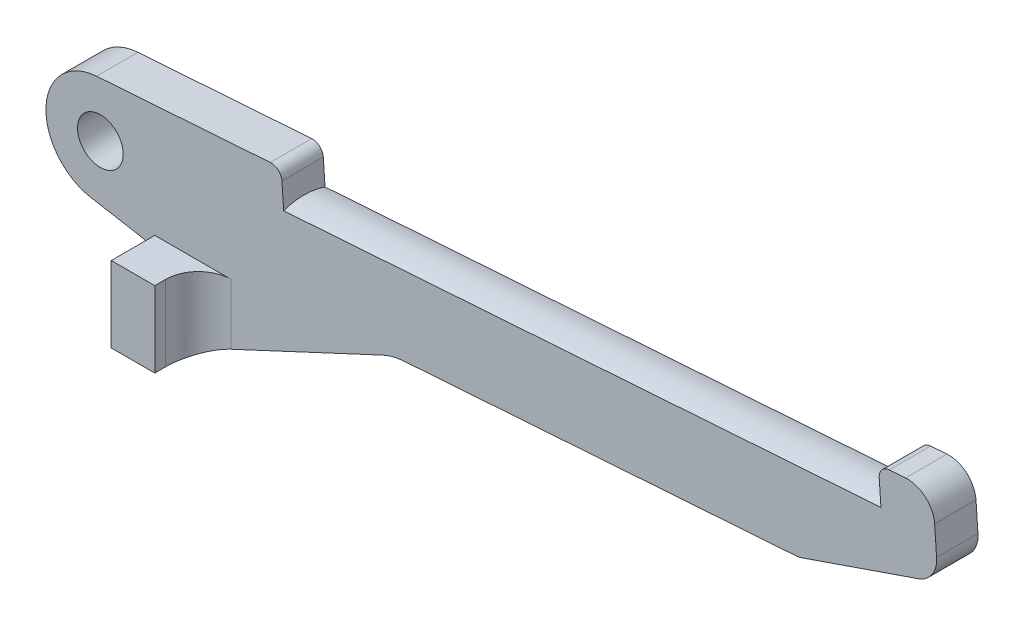
ISO-10303-21;
HEADER;
FILE_DESCRIPTION(('STEP AP214'),'2;1');
FILE_NAME('part.step','',(''),(''),'','','');
FILE_SCHEMA(('AUTOMOTIVE_DESIGN { 1 0 10303 214 1 1 1 1 }'));
ENDSEC;
DATA;
#1=APPLICATION_CONTEXT('core data for automotive mechanical design processes');
#2=APPLICATION_PROTOCOL_DEFINITION('international standard','automotive_design',2000,#1);
#3=PRODUCT_CONTEXT('',#1,'mechanical');
#4=PRODUCT('Part','Part','',(#3));
#5=PRODUCT_RELATED_PRODUCT_CATEGORY('part','',(#4));
#6=PRODUCT_DEFINITION_FORMATION('','',#4);
#7=PRODUCT_DEFINITION_CONTEXT('part definition',#1,'design');
#8=PRODUCT_DEFINITION('design','',#6,#7);
#9=PRODUCT_DEFINITION_SHAPE('','',#8);
#10=(LENGTH_UNIT() NAMED_UNIT(*) SI_UNIT(.MILLI.,.METRE.));
#11=(NAMED_UNIT(*) PLANE_ANGLE_UNIT() SI_UNIT($,.RADIAN.));
#12=(NAMED_UNIT(*) SI_UNIT($,.STERADIAN.) SOLID_ANGLE_UNIT());
#13=UNCERTAINTY_MEASURE_WITH_UNIT(LENGTH_MEASURE(1.E-05),#10,'distance_accuracy_value','');
#14=(GEOMETRIC_REPRESENTATION_CONTEXT(3) GLOBAL_UNCERTAINTY_ASSIGNED_CONTEXT((#13)) GLOBAL_UNIT_ASSIGNED_CONTEXT((#10,
#11,#12)) REPRESENTATION_CONTEXT('',''));
#15=CARTESIAN_POINT('',(0.,0.,0.));
#16=DIRECTION('',(0.,0.,1.));
#17=DIRECTION('',(1.,0.,0.));
#18=AXIS2_PLACEMENT_3D('',#15,#16,#17);
#19=CARTESIAN_POINT('',(0.,0.,7.6));
#20=DIRECTION('',(0.,0.,1.));
#21=DIRECTION('',(1.,0.,0.));
#22=AXIS2_PLACEMENT_3D('',#19,#20,#21);
#23=PLANE('',#22);
#24=DIRECTION('',(-0.997564050259824,-0.06975647374413,0.));
#25=VECTOR('',#24,1.);
#26=CARTESIAN_POINT('',(142.951658499973,20.0205727217529,7.6));
#27=LINE('',#26,#25);
#28=CARTESIAN_POINT('',(147.939478751272,20.3693550904736,7.6));
#29=VERTEX_POINT('',#28);
#30=CARTESIAN_POINT('',(144.946786600493,20.1600856692411,7.6));
#31=VERTEX_POINT('',#30);
#32=EDGE_CURVE('E389',#29,#31,#27,.T.);
#33=ORIENTED_EDGE('',*,*,#32,.T.);
#34=CARTESIAN_POINT('',(145.086299547981,18.1649575687215,7.6));
#35=DIRECTION('',(0.,0.,1.));
#36=DIRECTION('',(1.,0.,0.));
#37=AXIS2_PLACEMENT_3D('',#34,#35,#36);
#38=CIRCLE('',#37,2.);
#39=CARTESIAN_POINT('',(143.091171447462,18.0254446212332,7.6));
#40=VERTEX_POINT('',#39);
#41=EDGE_CURVE('E284',#31,#40,#38,.T.);
#42=ORIENTED_EDGE('',*,*,#41,.T.);
#43=DIRECTION('',(0.0697564737441314,-0.997564050259824,0.));
#44=VECTOR('',#43,1.);
#45=CARTESIAN_POINT('',(143.370197342438,14.0351884201939,7.6));
#46=LINE('',#45,#44);
#47=CARTESIAN_POINT('',(143.413275967594,13.4191353790388,7.6));
#48=VERTEX_POINT('',#47);
#49=EDGE_CURVE('E388',#40,#48,#46,.T.);
#50=ORIENTED_EDGE('',*,*,#49,.T.);
#51=DIRECTION('',(-0.997564050259824,-0.0697564737441294,0.));
#52=VECTOR('',#51,1.);
#53=CARTESIAN_POINT('',(153.466032644996,14.1220926047334,7.6));
#54=LINE('',#53,#52);
#55=CARTESIAN_POINT('',(33.6812304390136,5.74592326718459,7.6));
#56=VERTEX_POINT('',#55);
#57=EDGE_CURVE('E209',#48,#56,#54,.T.);
#58=ORIENTED_EDGE('',*,*,#57,.T.);
#59=DIRECTION('',(-0.0697564737441282,0.997564050259824,0.));
#60=VECTOR('',#59,1.);
#61=CARTESIAN_POINT('',(33.2196129713927,12.3473606098986,7.6));
#62=LINE('',#61,#60);
#63=CARTESIAN_POINT('',(33.359125918881,10.352232509379,7.6));
#64=VERTEX_POINT('',#63);
#65=EDGE_CURVE('E390',#56,#64,#62,.T.);
#66=ORIENTED_EDGE('',*,*,#65,.T.);
#67=CARTESIAN_POINT('',(31.3639978183613,10.2127195618907,7.6));
#68=DIRECTION('',(0.,0.,1.));
#69=DIRECTION('',(1.,0.,0.));
#70=AXIS2_PLACEMENT_3D('',#67,#68,#69);
#71=CIRCLE('',#70,2.);
#72=CARTESIAN_POINT('',(31.2244848708731,12.2078476624104,7.6));
#73=VERTEX_POINT('',#72);
#74=EDGE_CURVE('E47',#64,#73,#71,.T.);
#75=ORIENTED_EDGE('',*,*,#74,.T.);
#76=DIRECTION('',(-0.997564050259824,-0.0697564737441296,0.));
#77=VECTOR('',#76,1.);
#78=CARTESIAN_POINT('',(-0.697564737441295,9.97564050259824,7.6));
#79=LINE('',#78,#77);
#80=CARTESIAN_POINT('',(-0.697564737441295,9.97564050259824,7.6));
#81=VERTEX_POINT('',#80);
#82=EDGE_CURVE('E293',#73,#81,#79,.T.);
#83=ORIENTED_EDGE('',*,*,#82,.T.);
#84=CARTESIAN_POINT('',(0.,0.,7.6));
#85=DIRECTION('',(0.,0.,1.));
#86=DIRECTION('',(1.,0.,0.));
#87=AXIS2_PLACEMENT_3D('',#84,#85,#86);
#88=CIRCLE('',#87,10.);
#89=CARTESIAN_POINT('',(-1.73648177666923,-9.8480775301221,7.6));
#90=VERTEX_POINT('',#89);
#91=EDGE_CURVE('E298',#81,#90,#88,.T.);
#92=ORIENTED_EDGE('',*,*,#91,.T.);
#93=DIRECTION('',(0.984807753012209,-0.173648177666923,0.));
#94=VECTOR('',#93,1.);
#95=CARTESIAN_POINT('',(-1.73648177666923,-9.8480775301221,7.6));
#96=LINE('',#95,#94);
#97=CARTESIAN_POINT('',(7.52094453300077,-11.4804115604372,7.6));
#98=VERTEX_POINT('',#97);
#99=EDGE_CURVE('E255',#90,#98,#96,.T.);
#100=ORIENTED_EDGE('',*,*,#99,.T.);
#101=CARTESIAN_POINT('',(7.,-14.4348348194739,7.6));
#102=DIRECTION('',(0.,0.,-1.));
#103=DIRECTION('',(-1.,0.,0.));
#104=AXIS2_PLACEMENT_3D('',#101,#102,#103);
#105=CIRCLE('',#104,3.);
#106=CARTESIAN_POINT('',(10.,-14.4348348194739,7.6));
#107=VERTEX_POINT('',#106);
#108=EDGE_CURVE('E252',#98,#107,#105,.T.);
#109=ORIENTED_EDGE('',*,*,#108,.T.);
#110=DIRECTION('',(0.,-1.,0.));
#111=VECTOR('',#110,1.);
#112=CARTESIAN_POINT('',(10.,-23.917535925942,7.6));
#113=LINE('',#112,#111);
#114=CARTESIAN_POINT('',(10.,-10.,7.6));
#115=VERTEX_POINT('',#114);
#116=EDGE_CURVE('E232',#115,#107,#113,.T.);
#117=ORIENTED_EDGE('',*,*,#116,.F.);
#118=DIRECTION('',(-1.,0.,0.));
#119=VECTOR('',#118,1.);
#120=CARTESIAN_POINT('',(10.,-10.,7.6));
#121=LINE('',#120,#119);
#122=CARTESIAN_POINT('',(24.,-10.,7.6));
#123=VERTEX_POINT('',#122);
#124=EDGE_CURVE('E223',#123,#115,#121,.T.);
#125=ORIENTED_EDGE('',*,*,#124,.F.);
#126=DIRECTION('',(0.,1.,0.));
#127=VECTOR('',#126,1.);
#128=CARTESIAN_POINT('',(24.,0.,7.6));
#129=LINE('',#128,#127);
#130=CARTESIAN_POINT('',(24.,-21.119689977012,7.6));
#131=VERTEX_POINT('',#130);
#132=EDGE_CURVE('E268',#123,#131,#129,.F.);
#133=ORIENTED_EDGE('',*,*,#132,.T.);
#134=DIRECTION('',(0.906307787036649,0.422618261740701,0.));
#135=VECTOR('',#134,1.);
#136=CARTESIAN_POINT('',(18.,-23.917535925942,7.6));
#137=LINE('',#136,#135);
#138=CARTESIAN_POINT('',(52.0166285974361,-8.05532150634318,7.6));
#139=VERTEX_POINT('',#138);
#140=EDGE_CURVE('E254',#131,#139,#137,.T.);
#141=ORIENTED_EDGE('',*,*,#140,.T.);
#142=CARTESIAN_POINT('',(56.2428112148431,-17.1183993767097,7.6));
#143=DIRECTION('',(0.,0.,-1.));
#144=DIRECTION('',(-1.,0.,0.));
#145=AXIS2_PLACEMENT_3D('',#142,#143,#144);
#146=CIRCLE('',#145,10.);
#147=CARTESIAN_POINT('',(55.5452464774018,-7.14275887411143,7.6));
#148=VERTEX_POINT('',#147);
#149=EDGE_CURVE('E406',#139,#148,#146,.T.);
#150=ORIENTED_EDGE('',*,*,#149,.T.);
#151=DIRECTION('',(0.997564050259824,0.0697564737441292,0.));
#152=VECTOR('',#151,1.);
#153=CARTESIAN_POINT('',(55.5452464774018,-7.14275887411143,7.6));
#154=LINE('',#153,#152);
#155=CARTESIAN_POINT('',(127.67480792198,-2.09896859540824,7.6));
#156=VERTEX_POINT('',#155);
#157=EDGE_CURVE('E404',#148,#156,#154,.T.);
#158=ORIENTED_EDGE('',*,*,#157,.T.);
#159=CARTESIAN_POINT('',(127.326025553259,2.88885165589089,7.6));
#160=DIRECTION('',(0.,0.,1.));
#161=DIRECTION('',(1.,0.,0.));
#162=AXIS2_PLACEMENT_3D('',#159,#160,#161);
#163=CIRCLE('',#162,5.);
#164=CARTESIAN_POINT('',(128.953866325545,-1.8387412221057,7.6));
#165=VERTEX_POINT('',#164);
#166=EDGE_CURVE('E402',#156,#165,#163,.T.);
#167=ORIENTED_EDGE('',*,*,#166,.T.);
#168=DIRECTION('',(0.945518575599318,0.325568154457154,0.));
#169=VECTOR('',#168,1.);
#170=CARTESIAN_POINT('',(150.276280031525,5.50315459884924,7.6));
#171=LINE('',#170,#169);
#172=CARTESIAN_POINT('',(150.276280031525,5.50315459884924,7.6));
#173=VERTEX_POINT('',#172);
#174=EDGE_CURVE('E400',#165,#173,#171,.T.);
#175=ORIENTED_EDGE('',*,*,#174,.T.);
#176=CARTESIAN_POINT('',(148.64843925924,10.2307474768458,7.6));
#177=DIRECTION('',(0.,0.,1.));
#178=DIRECTION('',(-1.,0.,0.));
#179=AXIS2_PLACEMENT_3D('',#176,#177,#178);
#180=CIRCLE('',#179,5.);
#181=CARTESIAN_POINT('',(153.636259510539,10.5795298455665,7.6));
#182=VERTEX_POINT('',#181);
#183=EDGE_CURVE('E398',#173,#182,#180,.T.);
#184=ORIENTED_EDGE('',*,*,#183,.T.);
#185=DIRECTION('',(-0.0697564737441285,0.997564050259824,0.));
#186=VECTOR('',#185,1.);
#187=CARTESIAN_POINT('',(153.636259510539,10.5795298455665,7.6));
#188=LINE('',#187,#186);
#189=CARTESIAN_POINT('',(153.276081371292,15.7303172078951,7.6));
#190=VERTEX_POINT('',#189);
#191=EDGE_CURVE('E396',#182,#190,#188,.T.);
#192=ORIENTED_EDGE('',*,*,#191,.T.);
#193=CARTESIAN_POINT('',(148.288261119993,15.3815348391744,7.6));
#194=DIRECTION('',(0.,0.,1.));
#195=DIRECTION('',(-1.,0.,0.));
#196=AXIS2_PLACEMENT_3D('',#193,#194,#195);
#197=CIRCLE('',#196,5.00000000000002);
#198=EDGE_CURVE('E392',#190,#29,#197,.T.);
#199=ORIENTED_EDGE('',*,*,#198,.T.);
#200=EDGE_LOOP('',(#33,#42,#50,#58,#66,#75,#83,#92,#100,#109,#117,#125,#133,#141,#150,#158,#167,
#175,#184,#192,#199));
#201=FACE_BOUND('',#200,.T.);
#202=CARTESIAN_POINT('',(0.,0.,7.6));
#203=DIRECTION('',(0.,0.,1.));
#204=DIRECTION('',(1.,0.,0.));
#205=AXIS2_PLACEMENT_3D('',#202,#203,#204);
#206=CIRCLE('',#205,4.2);
#207=CARTESIAN_POINT('',(4.2,0.,7.6));
#208=VERTEX_POINT('',#207);
#209=EDGE_CURVE('E245',#208,#208,#206,.T.);
#210=ORIENTED_EDGE('',*,*,#209,.F.);
#211=EDGE_LOOP('',(#210));
#212=FACE_BOUND('',#211,.T.);
#213=ADVANCED_FACE('F32',(#201,#212),#23,.T.);
#214=CARTESIAN_POINT('',(0.,0.,0.));
#215=DIRECTION('',(0.,0.,1.));
#216=DIRECTION('',(1.,0.,0.));
#217=AXIS2_PLACEMENT_3D('',#214,#215,#216);
#218=PLANE('',#217);
#219=DIRECTION('',(0.0697564737441314,-0.997564050259824,0.));
#220=VECTOR('',#219,1.);
#221=CARTESIAN_POINT('',(143.370197342438,14.0351884201939,0.));
#222=LINE('',#221,#220);
#223=CARTESIAN_POINT('',(143.091171447462,18.0254446212332,0.));
#224=VERTEX_POINT('',#223);
#225=CARTESIAN_POINT('',(143.413275967594,13.4191353790388,0.));
#226=VERTEX_POINT('',#225);
#227=EDGE_CURVE('E190',#224,#226,#222,.T.);
#228=ORIENTED_EDGE('',*,*,#227,.F.);
#229=CARTESIAN_POINT('',(145.086299547981,18.1649575687215,0.));
#230=DIRECTION('',(0.,0.,1.));
#231=DIRECTION('',(1.,0.,0.));
#232=AXIS2_PLACEMENT_3D('',#229,#230,#231);
#233=CIRCLE('',#232,2.);
#234=CARTESIAN_POINT('',(144.946786600493,20.1600856692411,0.));
#235=VERTEX_POINT('',#234);
#236=EDGE_CURVE('E279',#224,#235,#233,.F.);
#237=ORIENTED_EDGE('',*,*,#236,.T.);
#238=DIRECTION('',(-0.997564050259824,-0.06975647374413,0.));
#239=VECTOR('',#238,1.);
#240=CARTESIAN_POINT('',(142.951658499973,20.0205727217529,0.));
#241=LINE('',#240,#239);
#242=CARTESIAN_POINT('',(147.939478751272,20.3693550904736,0.));
#243=VERTEX_POINT('',#242);
#244=EDGE_CURVE('E201',#243,#235,#241,.T.);
#245=ORIENTED_EDGE('',*,*,#244,.F.);
#246=CARTESIAN_POINT('',(148.288261119993,15.3815348391744,0.));
#247=DIRECTION('',(0.,0.,1.));
#248=DIRECTION('',(-1.,0.,0.));
#249=AXIS2_PLACEMENT_3D('',#246,#247,#248);
#250=CIRCLE('',#249,5.00000000000002);
#251=CARTESIAN_POINT('',(153.276081371292,15.7303172078951,0.));
#252=VERTEX_POINT('',#251);
#253=EDGE_CURVE('E373',#252,#243,#250,.T.);
#254=ORIENTED_EDGE('',*,*,#253,.F.);
#255=DIRECTION('',(-0.0697564737441285,0.997564050259824,0.));
#256=VECTOR('',#255,1.);
#257=CARTESIAN_POINT('',(153.636259510539,10.5795298455665,0.));
#258=LINE('',#257,#256);
#259=CARTESIAN_POINT('',(153.636259510539,10.5795298455665,0.));
#260=VERTEX_POINT('',#259);
#261=EDGE_CURVE('E371',#260,#252,#258,.T.);
#262=ORIENTED_EDGE('',*,*,#261,.F.);
#263=CARTESIAN_POINT('',(148.64843925924,10.2307474768458,0.));
#264=DIRECTION('',(0.,0.,1.));
#265=DIRECTION('',(-1.,0.,0.));
#266=AXIS2_PLACEMENT_3D('',#263,#264,#265);
#267=CIRCLE('',#266,5.);
#268=CARTESIAN_POINT('',(150.276280031525,5.50315459884924,0.));
#269=VERTEX_POINT('',#268);
#270=EDGE_CURVE('E369',#269,#260,#267,.T.);
#271=ORIENTED_EDGE('',*,*,#270,.F.);
#272=DIRECTION('',(0.945518575599318,0.325568154457154,0.));
#273=VECTOR('',#272,1.);
#274=CARTESIAN_POINT('',(150.276280031525,5.50315459884924,0.));
#275=LINE('',#274,#273);
#276=CARTESIAN_POINT('',(128.953866325545,-1.8387412221057,0.));
#277=VERTEX_POINT('',#276);
#278=EDGE_CURVE('E367',#277,#269,#275,.T.);
#279=ORIENTED_EDGE('',*,*,#278,.F.);
#280=CARTESIAN_POINT('',(127.326025553259,2.88885165589089,0.));
#281=DIRECTION('',(0.,0.,1.));
#282=DIRECTION('',(1.,0.,0.));
#283=AXIS2_PLACEMENT_3D('',#280,#281,#282);
#284=CIRCLE('',#283,5.);
#285=CARTESIAN_POINT('',(127.67480792198,-2.09896859540824,0.));
#286=VERTEX_POINT('',#285);
#287=EDGE_CURVE('E365',#286,#277,#284,.T.);
#288=ORIENTED_EDGE('',*,*,#287,.F.);
#289=DIRECTION('',(0.997564050259824,0.0697564737441292,0.));
#290=VECTOR('',#289,1.);
#291=CARTESIAN_POINT('',(55.5452464774018,-7.14275887411143,0.));
#292=LINE('',#291,#290);
#293=CARTESIAN_POINT('',(55.5452464774018,-7.14275887411143,0.));
#294=VERTEX_POINT('',#293);
#295=EDGE_CURVE('E363',#294,#286,#292,.T.);
#296=ORIENTED_EDGE('',*,*,#295,.F.);
#297=CARTESIAN_POINT('',(56.2428112148431,-17.1183993767097,0.));
#298=DIRECTION('',(0.,0.,-1.));
#299=DIRECTION('',(-1.,0.,0.));
#300=AXIS2_PLACEMENT_3D('',#297,#298,#299);
#301=CIRCLE('',#300,10.);
#302=CARTESIAN_POINT('',(52.0166285974361,-8.05532150634318,0.));
#303=VERTEX_POINT('',#302);
#304=EDGE_CURVE('E361',#303,#294,#301,.T.);
#305=ORIENTED_EDGE('',*,*,#304,.F.);
#306=DIRECTION('',(0.906307787036649,0.422618261740701,0.));
#307=VECTOR('',#306,1.);
#308=CARTESIAN_POINT('',(18.,-23.917535925942,0.));
#309=LINE('',#308,#307);
#310=CARTESIAN_POINT('',(18.,-23.917535925942,0.));
#311=VERTEX_POINT('',#310);
#312=EDGE_CURVE('E359',#311,#303,#309,.T.);
#313=ORIENTED_EDGE('',*,*,#312,.F.);
#314=DIRECTION('',(1.,0.,0.));
#315=VECTOR('',#314,1.);
#316=CARTESIAN_POINT('',(10.,-23.917535925942,0.));
#317=LINE('',#316,#315);
#318=CARTESIAN_POINT('',(10.,-23.917535925942,0.));
#319=VERTEX_POINT('',#318);
#320=EDGE_CURVE('E357',#319,#311,#317,.T.);
#321=ORIENTED_EDGE('',*,*,#320,.F.);
#322=DIRECTION('',(0.,-1.,0.));
#323=VECTOR('',#322,1.);
#324=CARTESIAN_POINT('',(10.,-14.4348348194739,0.));
#325=LINE('',#324,#323);
#326=CARTESIAN_POINT('',(10.,-14.4348348194739,0.));
#327=VERTEX_POINT('',#326);
#328=EDGE_CURVE('E355',#327,#319,#325,.T.);
#329=ORIENTED_EDGE('',*,*,#328,.F.);
#330=CARTESIAN_POINT('',(7.,-14.4348348194739,0.));
#331=DIRECTION('',(0.,0.,-1.));
#332=DIRECTION('',(-1.,0.,0.));
#333=AXIS2_PLACEMENT_3D('',#330,#331,#332);
#334=CIRCLE('',#333,3.);
#335=CARTESIAN_POINT('',(7.52094453300077,-11.4804115604372,0.));
#336=VERTEX_POINT('',#335);
#337=EDGE_CURVE('E348',#336,#327,#334,.T.);
#338=ORIENTED_EDGE('',*,*,#337,.F.);
#339=DIRECTION('',(0.984807753012209,-0.173648177666923,0.));
#340=VECTOR('',#339,1.);
#341=CARTESIAN_POINT('',(-1.73648177666923,-9.8480775301221,0.));
#342=LINE('',#341,#340);
#343=CARTESIAN_POINT('',(-1.73648177666923,-9.8480775301221,0.));
#344=VERTEX_POINT('',#343);
#345=EDGE_CURVE('E343',#344,#336,#342,.T.);
#346=ORIENTED_EDGE('',*,*,#345,.F.);
#347=CARTESIAN_POINT('',(0.,0.,0.));
#348=DIRECTION('',(0.,0.,1.));
#349=DIRECTION('',(1.,0.,0.));
#350=AXIS2_PLACEMENT_3D('',#347,#348,#349);
#351=CIRCLE('',#350,10.);
#352=CARTESIAN_POINT('',(-0.697564737441295,9.97564050259824,0.));
#353=VERTEX_POINT('',#352);
#354=EDGE_CURVE('E297',#353,#344,#351,.T.);
#355=ORIENTED_EDGE('',*,*,#354,.F.);
#356=DIRECTION('',(-0.997564050259824,-0.0697564737441296,0.));
#357=VECTOR('',#356,1.);
#358=CARTESIAN_POINT('',(-0.697564737441295,9.97564050259824,0.));
#359=LINE('',#358,#357);
#360=CARTESIAN_POINT('',(31.2244848708731,12.2078476624104,0.));
#361=VERTEX_POINT('',#360);
#362=EDGE_CURVE('E291',#361,#353,#359,.T.);
#363=ORIENTED_EDGE('',*,*,#362,.F.);
#364=CARTESIAN_POINT('',(31.3639978183613,10.2127195618907,0.));
#365=DIRECTION('',(0.,0.,1.));
#366=DIRECTION('',(1.,0.,0.));
#367=AXIS2_PLACEMENT_3D('',#364,#365,#366);
#368=CIRCLE('',#367,2.);
#369=CARTESIAN_POINT('',(33.359125918881,10.352232509379,0.));
#370=VERTEX_POINT('',#369);
#371=EDGE_CURVE('E277',#361,#370,#368,.F.);
#372=ORIENTED_EDGE('',*,*,#371,.T.);
#373=DIRECTION('',(-0.0697564737441282,0.997564050259824,0.));
#374=VECTOR('',#373,1.);
#375=CARTESIAN_POINT('',(33.2196129713927,12.3473606098986,0.));
#376=LINE('',#375,#374);
#377=CARTESIAN_POINT('',(33.6812304390136,5.7459232671846,0.));
#378=VERTEX_POINT('',#377);
#379=EDGE_CURVE('E200',#378,#370,#376,.T.);
#380=ORIENTED_EDGE('',*,*,#379,.F.);
#381=DIRECTION('',(-0.997564050259824,-0.0697564737441294,0.));
#382=VECTOR('',#381,1.);
#383=CARTESIAN_POINT('',(153.466032644996,14.1220926047334,0.));
#384=LINE('',#383,#382);
#385=EDGE_CURVE('E207',#226,#378,#384,.T.);
#386=ORIENTED_EDGE('',*,*,#385,.F.);
#387=EDGE_LOOP('',(#228,#237,#245,#254,#262,#271,#279,#288,#296,#305,#313,#321,#329,#338,#346,
#355,#363,#372,#380,#386));
#388=FACE_BOUND('',#387,.T.);
#389=CARTESIAN_POINT('',(0.,0.,0.));
#390=DIRECTION('',(0.,0.,1.));
#391=DIRECTION('',(1.,0.,0.));
#392=AXIS2_PLACEMENT_3D('',#389,#390,#391);
#393=CIRCLE('',#392,4.2);
#394=CARTESIAN_POINT('',(4.2,0.,0.));
#395=VERTEX_POINT('',#394);
#396=EDGE_CURVE('E241',#395,#395,#393,.T.);
#397=ORIENTED_EDGE('',*,*,#396,.T.);
#398=EDGE_LOOP('',(#397));
#399=FACE_BOUND('',#398,.T.);
#400=ADVANCED_FACE('F212',(#388,#399),#218,.F.);
#401=CARTESIAN_POINT('',(0.,0.,7.6));
#402=DIRECTION('',(0.,0.,-1.));
#403=DIRECTION('',(-1.,0.,0.));
#404=AXIS2_PLACEMENT_3D('',#401,#402,#403);
#405=CYLINDRICAL_SURFACE('',#404,10.);
#406=ORIENTED_EDGE('',*,*,#354,.T.);
#407=DIRECTION('',(0.,0.,-1.));
#408=VECTOR('',#407,1.);
#409=CARTESIAN_POINT('',(-1.73648177666923,-9.8480775301221,7.6));
#410=LINE('',#409,#408);
#411=EDGE_CURVE('E250',#90,#344,#410,.T.);
#412=ORIENTED_EDGE('',*,*,#411,.F.);
#413=ORIENTED_EDGE('',*,*,#91,.F.);
#414=DIRECTION('',(0.,0.,-1.));
#415=VECTOR('',#414,1.);
#416=CARTESIAN_POINT('',(-0.697564737441295,9.97564050259824,7.6));
#417=LINE('',#416,#415);
#418=EDGE_CURVE('E304',#81,#353,#417,.T.);
#419=ORIENTED_EDGE('',*,*,#418,.T.);
#420=EDGE_LOOP('',(#406,#412,#413,#419));
#421=FACE_BOUND('',#420,.T.);
#422=ADVANCED_FACE('F346',(#421),#405,.T.);
#423=CARTESIAN_POINT('',(-1.73648177666923,-9.8480775301221,7.6));
#424=DIRECTION('',(0.173648177666923,0.984807753012209,0.));
#425=DIRECTION('',(-0.984807753012209,0.173648177666923,0.));
#426=AXIS2_PLACEMENT_3D('',#423,#424,#425);
#427=PLANE('',#426);
#428=ORIENTED_EDGE('',*,*,#345,.T.);
#429=DIRECTION('',(0.,0.,-1.));
#430=VECTOR('',#429,1.);
#431=CARTESIAN_POINT('',(7.52094453300077,-11.4804115604372,7.6));
#432=LINE('',#431,#430);
#433=EDGE_CURVE('E261',#98,#336,#432,.T.);
#434=ORIENTED_EDGE('',*,*,#433,.F.);
#435=ORIENTED_EDGE('',*,*,#99,.F.);
#436=ORIENTED_EDGE('',*,*,#411,.T.);
#437=EDGE_LOOP('',(#428,#434,#435,#436));
#438=FACE_BOUND('',#437,.T.);
#439=ADVANCED_FACE('F342',(#438),#427,.F.);
#440=CARTESIAN_POINT('',(7.,-14.4348348194739,7.6));
#441=DIRECTION('',(0.,0.,-1.));
#442=DIRECTION('',(-1.,0.,0.));
#443=AXIS2_PLACEMENT_3D('',#440,#441,#442);
#444=CYLINDRICAL_SURFACE('',#443,3.);
#445=ORIENTED_EDGE('',*,*,#337,.T.);
#446=DIRECTION('',(0.,0.,-1.));
#447=VECTOR('',#446,1.);
#448=CARTESIAN_POINT('',(10.,-14.4348348194739,7.6));
#449=LINE('',#448,#447);
#450=EDGE_CURVE('E258',#107,#327,#449,.T.);
#451=ORIENTED_EDGE('',*,*,#450,.F.);
#452=ORIENTED_EDGE('',*,*,#108,.F.);
#453=ORIENTED_EDGE('',*,*,#433,.T.);
#454=EDGE_LOOP('',(#445,#451,#452,#453));
#455=FACE_BOUND('',#454,.T.);
#456=ADVANCED_FACE('F478',(#455),#444,.F.);
#457=CARTESIAN_POINT('',(10.,-14.4348348194739,7.6));
#458=DIRECTION('',(1.,0.,0.));
#459=DIRECTION('',(0.,0.,-1.));
#460=AXIS2_PLACEMENT_3D('',#457,#458,#459);
#461=PLANE('',#460);
#462=ORIENTED_EDGE('',*,*,#328,.T.);
#463=DIRECTION('',(0.,0.,-1.));
#464=VECTOR('',#463,1.);
#465=CARTESIAN_POINT('',(10.,-23.917535925942,7.6));
#466=LINE('',#465,#464);
#467=CARTESIAN_POINT('',(10.,-23.917535925942,15.6));
#468=VERTEX_POINT('',#467);
#469=EDGE_CURVE('E262',#468,#319,#466,.T.);
#470=ORIENTED_EDGE('',*,*,#469,.F.);
#471=DIRECTION('',(0.,-1.,0.));
#472=VECTOR('',#471,1.);
#473=CARTESIAN_POINT('',(10.,-23.917535925942,15.6));
#474=LINE('',#473,#472);
#475=CARTESIAN_POINT('',(10.,-10.,15.6));
#476=VERTEX_POINT('',#475);
#477=EDGE_CURVE('E219',#476,#468,#474,.T.);
#478=ORIENTED_EDGE('',*,*,#477,.F.);
#479=DIRECTION('',(0.,0.,-1.));
#480=VECTOR('',#479,1.);
#481=CARTESIAN_POINT('',(10.,-10.,15.6));
#482=LINE('',#481,#480);
#483=EDGE_CURVE('E229',#476,#115,#482,.T.);
#484=ORIENTED_EDGE('',*,*,#483,.T.);
#485=ORIENTED_EDGE('',*,*,#116,.T.);
#486=ORIENTED_EDGE('',*,*,#450,.T.);
#487=EDGE_LOOP('',(#462,#470,#478,#484,#485,#486));
#488=FACE_BOUND('',#487,.T.);
#489=ADVANCED_FACE('F474',(#488),#461,.F.);
#490=CARTESIAN_POINT('',(10.,-23.917535925942,7.6));
#491=DIRECTION('',(0.,1.,0.));
#492=DIRECTION('',(0.,0.,1.));
#493=AXIS2_PLACEMENT_3D('',#490,#491,#492);
#494=PLANE('',#493);
#495=ORIENTED_EDGE('',*,*,#320,.T.);
#496=DIRECTION('',(0.,0.,-1.));
#497=VECTOR('',#496,1.);
#498=CARTESIAN_POINT('',(18.,-23.917535925942,7.6));
#499=LINE('',#498,#497);
#500=CARTESIAN_POINT('',(18.,-23.917535925942,13.6));
#501=VERTEX_POINT('',#500);
#502=EDGE_CURVE('E330',#501,#311,#499,.T.);
#503=ORIENTED_EDGE('',*,*,#502,.F.);
#504=DIRECTION('',(0.,0.,-1.));
#505=VECTOR('',#504,1.);
#506=CARTESIAN_POINT('',(18.,-23.917535925942,15.6));
#507=LINE('',#506,#505);
#508=CARTESIAN_POINT('',(18.,-23.917535925942,15.6));
#509=VERTEX_POINT('',#508);
#510=EDGE_CURVE('E238',#509,#501,#507,.T.);
#511=ORIENTED_EDGE('',*,*,#510,.F.);
#512=DIRECTION('',(1.,0.,0.));
#513=VECTOR('',#512,1.);
#514=CARTESIAN_POINT('',(10.,-23.917535925942,15.6));
#515=LINE('',#514,#513);
#516=EDGE_CURVE('E222',#468,#509,#515,.T.);
#517=ORIENTED_EDGE('',*,*,#516,.F.);
#518=ORIENTED_EDGE('',*,*,#469,.T.);
#519=EDGE_LOOP('',(#495,#503,#511,#517,#518));
#520=FACE_BOUND('',#519,.T.);
#521=ADVANCED_FACE('F470',(#520),#494,.F.);
#522=CARTESIAN_POINT('',(18.,-23.917535925942,7.6));
#523=DIRECTION('',(-0.422618261740701,0.906307787036649,0.));
#524=DIRECTION('',(-0.906307787036649,-0.422618261740701,0.));
#525=AXIS2_PLACEMENT_3D('',#522,#523,#524);
#526=PLANE('',#525);
#527=ORIENTED_EDGE('',*,*,#312,.T.);
#528=DIRECTION('',(0.,0.,-1.));
#529=VECTOR('',#528,1.);
#530=CARTESIAN_POINT('',(52.0166285974361,-8.05532150634318,7.6));
#531=LINE('',#530,#529);
#532=EDGE_CURVE('E327',#139,#303,#531,.T.);
#533=ORIENTED_EDGE('',*,*,#532,.F.);
#534=ORIENTED_EDGE('',*,*,#140,.F.);
#535=CARTESIAN_POINT('',(24.,-21.119689977012,13.6));
#536=DIRECTION('',(-0.422618261740701,0.906307787036649,0.));
#537=DIRECTION('',(0.906307787036649,0.422618261740701,0.));
#538=AXIS2_PLACEMENT_3D('',#535,#536,#537);
#539=ELLIPSE('',#538,6.62026751377496,6.);
#540=EDGE_CURVE('E273',#131,#501,#539,.T.);
#541=ORIENTED_EDGE('',*,*,#540,.T.);
#542=ORIENTED_EDGE('',*,*,#502,.T.);
#543=EDGE_LOOP('',(#527,#533,#534,#541,#542));
#544=FACE_BOUND('',#543,.T.);
#545=ADVANCED_FACE('F466',(#544),#526,.F.);
#546=CARTESIAN_POINT('',(56.2428112148431,-17.1183993767097,7.6));
#547=DIRECTION('',(0.,0.,-1.));
#548=DIRECTION('',(-1.,0.,0.));
#549=AXIS2_PLACEMENT_3D('',#546,#547,#548);
#550=CYLINDRICAL_SURFACE('',#549,10.);
#551=ORIENTED_EDGE('',*,*,#304,.T.);
#552=DIRECTION('',(0.,0.,-1.));
#553=VECTOR('',#552,1.);
#554=CARTESIAN_POINT('',(55.5452464774018,-7.14275887411143,7.6));
#555=LINE('',#554,#553);
#556=EDGE_CURVE('E324',#148,#294,#555,.T.);
#557=ORIENTED_EDGE('',*,*,#556,.F.);
#558=ORIENTED_EDGE('',*,*,#149,.F.);
#559=ORIENTED_EDGE('',*,*,#532,.T.);
#560=EDGE_LOOP('',(#551,#557,#558,#559));
#561=FACE_BOUND('',#560,.T.);
#562=ADVANCED_FACE('F462',(#561),#550,.F.);
#563=CARTESIAN_POINT('',(55.5452464774018,-7.14275887411143,7.6));
#564=DIRECTION('',(-0.0697564737441292,0.997564050259824,0.));
#565=DIRECTION('',(-0.997564050259824,-0.0697564737441292,0.));
#566=AXIS2_PLACEMENT_3D('',#563,#564,#565);
#567=PLANE('',#566);
#568=ORIENTED_EDGE('',*,*,#295,.T.);
#569=DIRECTION('',(0.,0.,-1.));
#570=VECTOR('',#569,1.);
#571=CARTESIAN_POINT('',(127.67480792198,-2.09896859540824,7.6));
#572=LINE('',#571,#570);
#573=EDGE_CURVE('E321',#156,#286,#572,.T.);
#574=ORIENTED_EDGE('',*,*,#573,.F.);
#575=ORIENTED_EDGE('',*,*,#157,.F.);
#576=ORIENTED_EDGE('',*,*,#556,.T.);
#577=EDGE_LOOP('',(#568,#574,#575,#576));
#578=FACE_BOUND('',#577,.T.);
#579=ADVANCED_FACE('F458',(#578),#567,.F.);
#580=CARTESIAN_POINT('',(127.326025553259,2.88885165589089,7.6));
#581=DIRECTION('',(0.,0.,-1.));
#582=DIRECTION('',(-1.,0.,0.));
#583=AXIS2_PLACEMENT_3D('',#580,#581,#582);
#584=CYLINDRICAL_SURFACE('',#583,5.);
#585=ORIENTED_EDGE('',*,*,#287,.T.);
#586=DIRECTION('',(0.,0.,-1.));
#587=VECTOR('',#586,1.);
#588=CARTESIAN_POINT('',(128.953866325545,-1.8387412221057,7.6));
#589=LINE('',#588,#587);
#590=EDGE_CURVE('E318',#165,#277,#589,.T.);
#591=ORIENTED_EDGE('',*,*,#590,.F.);
#592=ORIENTED_EDGE('',*,*,#166,.F.);
#593=ORIENTED_EDGE('',*,*,#573,.T.);
#594=EDGE_LOOP('',(#585,#591,#592,#593));
#595=FACE_BOUND('',#594,.T.);
#596=ADVANCED_FACE('F454',(#595),#584,.T.);
#597=CARTESIAN_POINT('',(150.276280031525,5.50315459884924,7.6));
#598=DIRECTION('',(-0.325568154457154,0.945518575599318,0.));
#599=DIRECTION('',(-0.945518575599318,-0.325568154457154,0.));
#600=AXIS2_PLACEMENT_3D('',#597,#598,#599);
#601=PLANE('',#600);
#602=ORIENTED_EDGE('',*,*,#278,.T.);
#603=DIRECTION('',(0.,0.,-1.));
#604=VECTOR('',#603,1.);
#605=CARTESIAN_POINT('',(150.276280031525,5.50315459884924,7.6));
#606=LINE('',#605,#604);
#607=EDGE_CURVE('E315',#173,#269,#606,.T.);
#608=ORIENTED_EDGE('',*,*,#607,.F.);
#609=ORIENTED_EDGE('',*,*,#174,.F.);
#610=ORIENTED_EDGE('',*,*,#590,.T.);
#611=EDGE_LOOP('',(#602,#608,#609,#610));
#612=FACE_BOUND('',#611,.T.);
#613=ADVANCED_FACE('F450',(#612),#601,.F.);
#614=CARTESIAN_POINT('',(148.64843925924,10.2307474768458,7.6));
#615=DIRECTION('',(0.,0.,-1.));
#616=DIRECTION('',(-1.,0.,0.));
#617=AXIS2_PLACEMENT_3D('',#614,#615,#616);
#618=CYLINDRICAL_SURFACE('',#617,5.);
#619=ORIENTED_EDGE('',*,*,#270,.T.);
#620=DIRECTION('',(0.,0.,-1.));
#621=VECTOR('',#620,1.);
#622=CARTESIAN_POINT('',(153.636259510539,10.5795298455665,7.6));
#623=LINE('',#622,#621);
#624=EDGE_CURVE('E312',#182,#260,#623,.T.);
#625=ORIENTED_EDGE('',*,*,#624,.F.);
#626=ORIENTED_EDGE('',*,*,#183,.F.);
#627=ORIENTED_EDGE('',*,*,#607,.T.);
#628=EDGE_LOOP('',(#619,#625,#626,#627));
#629=FACE_BOUND('',#628,.T.);
#630=ADVANCED_FACE('F446',(#629),#618,.T.);
#631=CARTESIAN_POINT('',(153.636259510539,10.5795298455665,7.6));
#632=DIRECTION('',(-0.997564050259824,-0.0697564737441285,0.));
#633=DIRECTION('',(0.0697564737441285,-0.997564050259824,0.));
#634=AXIS2_PLACEMENT_3D('',#631,#632,#633);
#635=PLANE('',#634);
#636=ORIENTED_EDGE('',*,*,#261,.T.);
#637=DIRECTION('',(0.,0.,-1.));
#638=VECTOR('',#637,1.);
#639=CARTESIAN_POINT('',(153.276081371292,15.7303172078951,7.6));
#640=LINE('',#639,#638);
#641=EDGE_CURVE('E309',#190,#252,#640,.T.);
#642=ORIENTED_EDGE('',*,*,#641,.F.);
#643=ORIENTED_EDGE('',*,*,#191,.F.);
#644=ORIENTED_EDGE('',*,*,#624,.T.);
#645=EDGE_LOOP('',(#636,#642,#643,#644));
#646=FACE_BOUND('',#645,.T.);
#647=ADVANCED_FACE('F442',(#646),#635,.F.);
#648=CARTESIAN_POINT('',(148.288261119993,15.3815348391744,7.6));
#649=DIRECTION('',(0.,0.,-1.));
#650=DIRECTION('',(-1.,0.,0.));
#651=AXIS2_PLACEMENT_3D('',#648,#649,#650);
#652=CYLINDRICAL_SURFACE('',#651,5.00000000000002);
#653=ORIENTED_EDGE('',*,*,#253,.T.);
#654=DIRECTION('',(0.,0.,-1.));
#655=VECTOR('',#654,1.);
#656=CARTESIAN_POINT('',(147.939478751272,20.3693550904736,7.6));
#657=LINE('',#656,#655);
#658=EDGE_CURVE('E306',#29,#243,#657,.T.);
#659=ORIENTED_EDGE('',*,*,#658,.F.);
#660=ORIENTED_EDGE('',*,*,#198,.F.);
#661=ORIENTED_EDGE('',*,*,#641,.T.);
#662=EDGE_LOOP('',(#653,#659,#660,#661));
#663=FACE_BOUND('',#662,.T.);
#664=ADVANCED_FACE('F439',(#663),#652,.T.);
#665=CARTESIAN_POINT('',(142.951658499973,20.0205727217529,7.6));
#666=DIRECTION('',(0.06975647374413,-0.997564050259824,0.));
#667=DIRECTION('',(0.997564050259824,0.06975647374413,0.));
#668=AXIS2_PLACEMENT_3D('',#665,#666,#667);
#669=PLANE('',#668);
#670=ORIENTED_EDGE('',*,*,#244,.T.);
#671=DIRECTION('',(0.,0.,-1.));
#672=VECTOR('',#671,1.);
#673=CARTESIAN_POINT('',(144.946786600493,20.1600856692411,7.6));
#674=LINE('',#673,#672);
#675=EDGE_CURVE('E281',#235,#31,#674,.F.);
#676=ORIENTED_EDGE('',*,*,#675,.T.);
#677=ORIENTED_EDGE('',*,*,#32,.F.);
#678=ORIENTED_EDGE('',*,*,#658,.T.);
#679=EDGE_LOOP('',(#670,#676,#677,#678));
#680=FACE_BOUND('',#679,.T.);
#681=ADVANCED_FACE('F379',(#680),#669,.F.);
#682=CARTESIAN_POINT('',(143.370197342438,14.0351884201939,7.6));
#683=DIRECTION('',(0.997564050259824,0.0697564737441314,0.));
#684=DIRECTION('',(-0.0697564737441314,0.997564050259824,0.));
#685=AXIS2_PLACEMENT_3D('',#682,#683,#684);
#686=PLANE('',#685);
#687=ORIENTED_EDGE('',*,*,#49,.F.);
#688=DIRECTION('',(0.,0.,-1.));
#689=VECTOR('',#688,1.);
#690=CARTESIAN_POINT('',(143.091171447462,18.0254446212332,7.6));
#691=LINE('',#690,#689);
#692=EDGE_CURVE('E197',#40,#224,#691,.T.);
#693=ORIENTED_EDGE('',*,*,#692,.T.);
#694=ORIENTED_EDGE('',*,*,#227,.T.);
#695=CARTESIAN_POINT('',(144.207275027368,2.06441981707609,3.8));
#696=DIRECTION('',(0.997564050259824,0.0697564737441314,0.));
#697=DIRECTION('',(-0.0697564737441314,0.997564050259824,0.));
#698=AXIS2_PLACEMENT_3D('',#695,#696,#697);
#699=CIRCLE('',#698,12.);
#700=EDGE_CURVE('E194',#226,#48,#699,.T.);
#701=ORIENTED_EDGE('',*,*,#700,.T.);
#702=EDGE_LOOP('',(#687,#693,#694,#701));
#703=FACE_BOUND('',#702,.T.);
#704=ADVANCED_FACE('F193',(#703),#686,.F.);
#705=CARTESIAN_POINT('',(33.2196129713927,12.3473606098986,7.6));
#706=DIRECTION('',(-0.997564050259824,-0.0697564737441282,0.));
#707=DIRECTION('',(0.0697564737441282,-0.997564050259824,0.));
#708=AXIS2_PLACEMENT_3D('',#705,#706,#707);
#709=PLANE('',#708);
#710=ORIENTED_EDGE('',*,*,#379,.T.);
#711=DIRECTION('',(0.,0.,-1.));
#712=VECTOR('',#711,1.);
#713=CARTESIAN_POINT('',(33.359125918881,10.352232509379,7.6));
#714=LINE('',#713,#712);
#715=EDGE_CURVE('E11',#370,#64,#714,.F.);
#716=ORIENTED_EDGE('',*,*,#715,.T.);
#717=ORIENTED_EDGE('',*,*,#65,.F.);
#718=CARTESIAN_POINT('',(34.4752294987871,-5.60879229477815,3.8));
#719=DIRECTION('',(0.997564050259824,0.0697564737441294,0.));
#720=DIRECTION('',(0.0697564737441294,-0.997564050259824,0.));
#721=AXIS2_PLACEMENT_3D('',#718,#719,#720);
#722=CIRCLE('',#721,12.);
#723=EDGE_CURVE('E214',#378,#56,#722,.T.);
#724=ORIENTED_EDGE('',*,*,#723,.F.);
#725=EDGE_LOOP('',(#710,#716,#717,#724));
#726=FACE_BOUND('',#725,.T.);
#727=ADVANCED_FACE('F424',(#726),#709,.F.);
#728=CARTESIAN_POINT('',(-0.697564737441295,9.97564050259824,7.6));
#729=DIRECTION('',(0.0697564737441296,-0.997564050259824,0.));
#730=DIRECTION('',(0.997564050259824,0.0697564737441296,0.));
#731=AXIS2_PLACEMENT_3D('',#728,#729,#730);
#732=PLANE('',#731);
#733=ORIENTED_EDGE('',*,*,#82,.F.);
#734=DIRECTION('',(0.,0.,-1.));
#735=VECTOR('',#734,1.);
#736=CARTESIAN_POINT('',(31.2244848708731,12.2078476624104,7.6));
#737=LINE('',#736,#735);
#738=EDGE_CURVE('E40',#73,#361,#737,.T.);
#739=ORIENTED_EDGE('',*,*,#738,.T.);
#740=ORIENTED_EDGE('',*,*,#362,.T.);
#741=ORIENTED_EDGE('',*,*,#418,.F.);
#742=EDGE_LOOP('',(#733,#739,#740,#741));
#743=FACE_BOUND('',#742,.T.);
#744=ADVANCED_FACE('F289',(#743),#732,.F.);
#745=CARTESIAN_POINT('',(0.,0.,7.6));
#746=DIRECTION('',(0.,0.,-1.));
#747=DIRECTION('',(-1.,0.,0.));
#748=AXIS2_PLACEMENT_3D('',#745,#746,#747);
#749=CYLINDRICAL_SURFACE('',#748,4.2);
#750=ORIENTED_EDGE('',*,*,#209,.T.);
#751=EDGE_LOOP('',(#750));
#752=FACE_BOUND('',#751,.T.);
#753=ORIENTED_EDGE('',*,*,#396,.F.);
#754=EDGE_LOOP('',(#753));
#755=FACE_BOUND('',#754,.T.);
#756=ADVANCED_FACE('F412',(#752,#755),#749,.F.);
#757=CARTESIAN_POINT('',(18.,-23.917535925942,15.6));
#758=DIRECTION('',(-1.,0.,0.));
#759=DIRECTION('',(0.,0.,1.));
#760=AXIS2_PLACEMENT_3D('',#757,#758,#759);
#761=PLANE('',#760);
#762=ORIENTED_EDGE('',*,*,#510,.T.);
#763=DIRECTION('',(0.,1.,0.));
#764=VECTOR('',#763,1.);
#765=CARTESIAN_POINT('',(18.,-23.917535925942,13.6));
#766=LINE('',#765,#764);
#767=CARTESIAN_POINT('',(18.,-10.,13.6));
#768=VERTEX_POINT('',#767);
#769=EDGE_CURVE('E265',#501,#768,#766,.T.);
#770=ORIENTED_EDGE('',*,*,#769,.T.);
#771=DIRECTION('',(0.,0.,-1.));
#772=VECTOR('',#771,1.);
#773=CARTESIAN_POINT('',(18.,-10.,15.6));
#774=LINE('',#773,#772);
#775=CARTESIAN_POINT('',(18.,-10.,15.6));
#776=VERTEX_POINT('',#775);
#777=EDGE_CURVE('E235',#776,#768,#774,.T.);
#778=ORIENTED_EDGE('',*,*,#777,.F.);
#779=DIRECTION('',(0.,1.,0.));
#780=VECTOR('',#779,1.);
#781=CARTESIAN_POINT('',(18.,-23.917535925942,15.6));
#782=LINE('',#781,#780);
#783=EDGE_CURVE('E225',#509,#776,#782,.T.);
#784=ORIENTED_EDGE('',*,*,#783,.F.);
#785=EDGE_LOOP('',(#762,#770,#778,#784));
#786=FACE_BOUND('',#785,.T.);
#787=ADVANCED_FACE('F414',(#786),#761,.F.);
#788=CARTESIAN_POINT('',(10.,-10.,15.6));
#789=DIRECTION('',(0.,-1.,0.));
#790=DIRECTION('',(0.,0.,-1.));
#791=AXIS2_PLACEMENT_3D('',#788,#789,#790);
#792=PLANE('',#791);
#793=ORIENTED_EDGE('',*,*,#124,.T.);
#794=ORIENTED_EDGE('',*,*,#483,.F.);
#795=DIRECTION('',(-1.,0.,0.));
#796=VECTOR('',#795,1.);
#797=CARTESIAN_POINT('',(10.,-10.,15.6));
#798=LINE('',#797,#796);
#799=EDGE_CURVE('E227',#776,#476,#798,.T.);
#800=ORIENTED_EDGE('',*,*,#799,.F.);
#801=ORIENTED_EDGE('',*,*,#777,.T.);
#802=CARTESIAN_POINT('',(24.,-10.,13.6));
#803=DIRECTION('',(0.,-1.,0.));
#804=DIRECTION('',(0.,0.,-1.));
#805=AXIS2_PLACEMENT_3D('',#802,#803,#804);
#806=CIRCLE('',#805,6.);
#807=EDGE_CURVE('E270',#768,#123,#806,.T.);
#808=ORIENTED_EDGE('',*,*,#807,.T.);
#809=EDGE_LOOP('',(#793,#794,#800,#801,#808));
#810=FACE_BOUND('',#809,.T.);
#811=ADVANCED_FACE('F421',(#810),#792,.F.);
#812=CARTESIAN_POINT('',(10.,-10.,15.6));
#813=DIRECTION('',(0.,0.,-1.));
#814=DIRECTION('',(-1.,0.,0.));
#815=AXIS2_PLACEMENT_3D('',#812,#813,#814);
#816=PLANE('',#815);
#817=ORIENTED_EDGE('',*,*,#477,.T.);
#818=ORIENTED_EDGE('',*,*,#516,.T.);
#819=ORIENTED_EDGE('',*,*,#783,.T.);
#820=ORIENTED_EDGE('',*,*,#799,.T.);
#821=EDGE_LOOP('',(#817,#818,#819,#820));
#822=FACE_BOUND('',#821,.T.);
#823=ADVANCED_FACE('F488',(#822),#816,.F.);
#824=CARTESIAN_POINT('',(24.,-23.917535925942,13.6));
#825=DIRECTION('',(0.,1.,0.));
#826=DIRECTION('',(0.,0.,1.));
#827=AXIS2_PLACEMENT_3D('',#824,#825,#826);
#828=CYLINDRICAL_SURFACE('',#827,6.);
#829=ORIENTED_EDGE('',*,*,#540,.F.);
#830=ORIENTED_EDGE('',*,*,#132,.F.);
#831=ORIENTED_EDGE('',*,*,#807,.F.);
#832=ORIENTED_EDGE('',*,*,#769,.F.);
#833=EDGE_LOOP('',(#829,#830,#831,#832));
#834=FACE_BOUND('',#833,.T.);
#835=ADVANCED_FACE('F486',(#834),#828,.F.);
#836=CARTESIAN_POINT('',(154.260031704769,2.76737704277064,3.8));
#837=DIRECTION('',(-0.997564050259824,-0.0697564737441294,0.));
#838=DIRECTION('',(0.0697564737441294,-0.997564050259824,0.));
#839=AXIS2_PLACEMENT_3D('',#836,#837,#838);
#840=CYLINDRICAL_SURFACE('',#839,12.);
#841=ORIENTED_EDGE('',*,*,#723,.T.);
#842=ORIENTED_EDGE('',*,*,#57,.F.);
#843=ORIENTED_EDGE('',*,*,#700,.F.);
#844=ORIENTED_EDGE('',*,*,#385,.T.);
#845=EDGE_LOOP('',(#841,#842,#843,#844));
#846=FACE_BOUND('',#845,.T.);
#847=ADVANCED_FACE('F206',(#846),#840,.T.);
#848=CARTESIAN_POINT('',(145.086299547981,18.1649575687215,7.6));
#849=DIRECTION('',(0.,0.,-1.));
#850=DIRECTION('',(-1.,0.,0.));
#851=AXIS2_PLACEMENT_3D('',#848,#849,#850);
#852=CYLINDRICAL_SURFACE('',#851,2.);
#853=ORIENTED_EDGE('',*,*,#41,.F.);
#854=ORIENTED_EDGE('',*,*,#675,.F.);
#855=ORIENTED_EDGE('',*,*,#236,.F.);
#856=ORIENTED_EDGE('',*,*,#692,.F.);
#857=EDGE_LOOP('',(#853,#854,#855,#856));
#858=FACE_BOUND('',#857,.T.);
#859=ADVANCED_FACE('F386',(#858),#852,.T.);
#860=CARTESIAN_POINT('',(31.3639978183613,10.2127195618907,7.6));
#861=DIRECTION('',(0.,0.,-1.));
#862=DIRECTION('',(-1.,0.,0.));
#863=AXIS2_PLACEMENT_3D('',#860,#861,#862);
#864=CYLINDRICAL_SURFACE('',#863,2.);
#865=ORIENTED_EDGE('',*,*,#74,.F.);
#866=ORIENTED_EDGE('',*,*,#715,.F.);
#867=ORIENTED_EDGE('',*,*,#371,.F.);
#868=ORIENTED_EDGE('',*,*,#738,.F.);
#869=EDGE_LOOP('',(#865,#866,#867,#868));
#870=FACE_BOUND('',#869,.T.);
#871=ADVANCED_FACE('F34',(#870),#864,.T.);
#872=CLOSED_SHELL('',(#213,#400,#422,#439,#456,#489,#521,#545,#562,#579,#596,#613,#630,#647,
#664,#681,#704,#727,#744,#756,#787,#811,#823,#835,#847,#859,#871));
#873=MANIFOLD_SOLID_BREP('B2',#872);
#874=ADVANCED_BREP_SHAPE_REPRESENTATION('',(#18,#873),#14);
#875=SHAPE_DEFINITION_REPRESENTATION(#9,#874);
ENDSEC;
END-ISO-10303-21;
